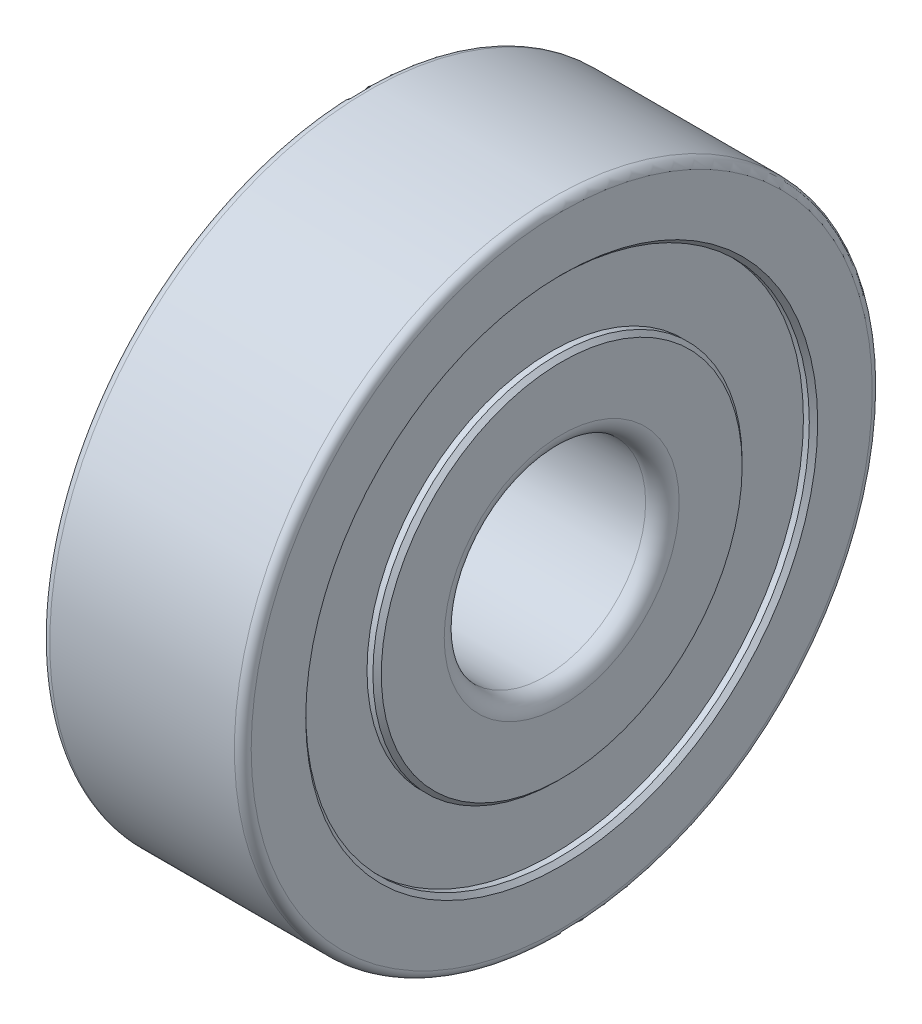
ISO-10303-21;
HEADER;
FILE_DESCRIPTION(('STEP AP214'),'2;1');
FILE_NAME('part.step','',(''),(''),'','','');
FILE_SCHEMA(('AUTOMOTIVE_DESIGN { 1 0 10303 214 1 1 1 1 }'));
ENDSEC;
DATA;
#1=APPLICATION_CONTEXT('core data for automotive mechanical design processes');
#2=APPLICATION_PROTOCOL_DEFINITION('international standard','automotive_design',2000,#1);
#3=PRODUCT_CONTEXT('',#1,'mechanical');
#4=PRODUCT('Part','Part','',(#3));
#5=PRODUCT_RELATED_PRODUCT_CATEGORY('part','',(#4));
#6=PRODUCT_DEFINITION_FORMATION('','',#4);
#7=PRODUCT_DEFINITION_CONTEXT('part definition',#1,'design');
#8=PRODUCT_DEFINITION('design','',#6,#7);
#9=PRODUCT_DEFINITION_SHAPE('','',#8);
#10=(LENGTH_UNIT() NAMED_UNIT(*) SI_UNIT(.MILLI.,.METRE.));
#11=(NAMED_UNIT(*) PLANE_ANGLE_UNIT() SI_UNIT($,.RADIAN.));
#12=(NAMED_UNIT(*) SI_UNIT($,.STERADIAN.) SOLID_ANGLE_UNIT());
#13=UNCERTAINTY_MEASURE_WITH_UNIT(LENGTH_MEASURE(1.E-05),#10,'distance_accuracy_value','');
#14=(GEOMETRIC_REPRESENTATION_CONTEXT(3) GLOBAL_UNCERTAINTY_ASSIGNED_CONTEXT((#13)) GLOBAL_UNIT_ASSIGNED_CONTEXT((#10,
#11,#12)) REPRESENTATION_CONTEXT('',''));
#15=CARTESIAN_POINT('',(0.,0.,0.));
#16=DIRECTION('',(0.,0.,1.));
#17=DIRECTION('',(1.,0.,0.));
#18=AXIS2_PLACEMENT_3D('',#15,#16,#17);
#19=CARTESIAN_POINT('',(-3.,4.41941738241598,-4.41941738241587));
#20=DIRECTION('',(0.,0.707106781186556,-0.707106781186539));
#21=DIRECTION('',(1.,0.,0.));
#22=AXIS2_PLACEMENT_3D('',#19,#20,#21);
#23=SPHERICAL_SURFACE('',#22,1.5);
#24=CARTESIAN_POINT('',(-3.,5.48007755419581,-5.48007755419568));
#25=VERTEX_POINT('',#24);
#26=VERTEX_LOOP('',#25);
#27=FACE_BOUND('',#26,.T.);
#28=ADVANCED_FACE('F41',(#27),#23,.T.);
#29=CLOSED_SHELL('',(#28));
#30=MANIFOLD_SOLID_BREP('B2',#29);
#31=CARTESIAN_POINT('',(-3.,0.,-6.25));
#32=DIRECTION('',(0.,0.,-1.));
#33=DIRECTION('',(1.,0.,0.));
#34=AXIS2_PLACEMENT_3D('',#31,#32,#33);
#35=SPHERICAL_SURFACE('',#34,1.5);
#36=CARTESIAN_POINT('',(-3.,0.,-7.75));
#37=VERTEX_POINT('',#36);
#38=VERTEX_LOOP('',#37);
#39=FACE_BOUND('',#38,.T.);
#40=ADVANCED_FACE('F59',(#39),#35,.T.);
#41=CLOSED_SHELL('',(#40));
#42=MANIFOLD_SOLID_BREP('B6',#41);
#43=CARTESIAN_POINT('',(-3.,-4.41941738241588,-4.41941738241596));
#44=DIRECTION('',(0.,-0.707106781186541,-0.707106781186554));
#45=DIRECTION('',(1.,0.,0.));
#46=AXIS2_PLACEMENT_3D('',#43,#44,#45);
#47=SPHERICAL_SURFACE('',#46,1.5);
#48=CARTESIAN_POINT('',(-3.,-5.4800775541957,-5.48007755419579));
#49=VERTEX_POINT('',#48);
#50=VERTEX_LOOP('',#49);
#51=FACE_BOUND('',#50,.T.);
#52=ADVANCED_FACE('F77',(#51),#47,.T.);
#53=CLOSED_SHELL('',(#52));
#54=MANIFOLD_SOLID_BREP('B37',#53);
#55=CARTESIAN_POINT('',(-3.,-6.25,0.));
#56=DIRECTION('',(0.,-1.,0.));
#57=DIRECTION('',(1.,0.,0.));
#58=AXIS2_PLACEMENT_3D('',#55,#56,#57);
#59=SPHERICAL_SURFACE('',#58,1.5);
#60=CARTESIAN_POINT('',(-3.,-7.75,0.));
#61=VERTEX_POINT('',#60);
#62=VERTEX_LOOP('',#61);
#63=FACE_BOUND('',#62,.T.);
#64=ADVANCED_FACE('F95',(#63),#59,.T.);
#65=CLOSED_SHELL('',(#64));
#66=MANIFOLD_SOLID_BREP('B55',#65);
#67=CARTESIAN_POINT('',(-3.,-4.41941738241595,4.4194173824159));
#68=DIRECTION('',(0.,-0.707106781186551,0.707106781186544));
#69=DIRECTION('',(1.,0.,0.));
#70=AXIS2_PLACEMENT_3D('',#67,#68,#69);
#71=SPHERICAL_SURFACE('',#70,1.5);
#72=CARTESIAN_POINT('',(-3.,-5.48007755419577,5.48007755419571));
#73=VERTEX_POINT('',#72);
#74=VERTEX_LOOP('',#73);
#75=FACE_BOUND('',#74,.T.);
#76=ADVANCED_FACE('F113',(#75),#71,.T.);
#77=CLOSED_SHELL('',(#76));
#78=MANIFOLD_SOLID_BREP('B73',#77);
#79=CARTESIAN_POINT('',(-3.,0.,6.25));
#80=DIRECTION('',(0.,0.,1.));
#81=DIRECTION('',(1.,0.,0.));
#82=AXIS2_PLACEMENT_3D('',#79,#80,#81);
#83=SPHERICAL_SURFACE('',#82,1.5);
#84=CARTESIAN_POINT('',(-3.,0.,7.75));
#85=VERTEX_POINT('',#84);
#86=VERTEX_LOOP('',#85);
#87=FACE_BOUND('',#86,.T.);
#88=ADVANCED_FACE('F131',(#87),#83,.T.);
#89=CLOSED_SHELL('',(#88));
#90=MANIFOLD_SOLID_BREP('B91',#89);
#91=CARTESIAN_POINT('',(-3.,4.41941738241592,4.41941738241593));
#92=DIRECTION('',(0.,0.707106781186546,0.707106781186549));
#93=DIRECTION('',(1.,0.,0.));
#94=AXIS2_PLACEMENT_3D('',#91,#92,#93);
#95=SPHERICAL_SURFACE('',#94,1.5);
#96=CARTESIAN_POINT('',(-3.,5.48007755419573,5.48007755419575));
#97=VERTEX_POINT('',#96);
#98=VERTEX_LOOP('',#97);
#99=FACE_BOUND('',#98,.T.);
#100=ADVANCED_FACE('F149',(#99),#95,.T.);
#101=CLOSED_SHELL('',(#100));
#102=MANIFOLD_SOLID_BREP('B109',#101);
#103=CARTESIAN_POINT('',(-3.,6.25,0.));
#104=DIRECTION('',(0.,1.,0.));
#105=DIRECTION('',(1.,0.,0.));
#106=AXIS2_PLACEMENT_3D('',#103,#104,#105);
#107=SPHERICAL_SURFACE('',#106,1.5);
#108=CARTESIAN_POINT('',(-3.,7.75,0.));
#109=VERTEX_POINT('',#108);
#110=VERTEX_LOOP('',#109);
#111=FACE_BOUND('',#110,.T.);
#112=ADVANCED_FACE('F168',(#111),#107,.T.);
#113=CLOSED_SHELL('',(#112));
#114=MANIFOLD_SOLID_BREP('B127',#113);
#115=CARTESIAN_POINT('',(0.,0.,0.));
#116=DIRECTION('',(1.,0.,0.));
#117=DIRECTION('',(0.,0.,-1.));
#118=AXIS2_PLACEMENT_3D('',#115,#116,#117);
#119=PLANE('',#118);
#120=CARTESIAN_POINT('',(0.,0.,0.));
#121=DIRECTION('',(1.,0.,0.));
#122=DIRECTION('',(0.,0.,-1.));
#123=AXIS2_PLACEMENT_3D('',#120,#121,#122);
#124=CIRCLE('',#123,9.25);
#125=CARTESIAN_POINT('',(0.,0.,-9.25));
#126=VERTEX_POINT('',#125);
#127=EDGE_CURVE('E196',#126,#126,#124,.T.);
#128=ORIENTED_EDGE('',*,*,#127,.T.);
#129=EDGE_LOOP('',(#128));
#130=FACE_BOUND('',#129,.T.);
#131=CARTESIAN_POINT('',(0.,0.,0.));
#132=DIRECTION('',(1.,0.,0.));
#133=DIRECTION('',(0.,0.,-1.));
#134=AXIS2_PLACEMENT_3D('',#131,#132,#133);
#135=CIRCLE('',#134,7.625);
#136=CARTESIAN_POINT('',(0.,0.,-7.625));
#137=VERTEX_POINT('',#136);
#138=EDGE_CURVE('E225',#137,#137,#135,.T.);
#139=ORIENTED_EDGE('',*,*,#138,.F.);
#140=EDGE_LOOP('',(#139));
#141=FACE_BOUND('',#140,.T.);
#142=ADVANCED_FACE('F181',(#130,#141),#119,.T.);
#143=CARTESIAN_POINT('',(-0.25,0.,0.));
#144=DIRECTION('',(1.,0.,0.));
#145=DIRECTION('',(0.,0.,-1.));
#146=AXIS2_PLACEMENT_3D('',#143,#144,#145);
#147=TOROIDAL_SURFACE('',#146,9.25,0.25);
#148=CARTESIAN_POINT('',(-0.250000000000002,0.,0.));
#149=DIRECTION('',(1.,0.,0.));
#150=DIRECTION('',(0.,0.,-1.));
#151=AXIS2_PLACEMENT_3D('',#148,#149,#150);
#152=CIRCLE('',#151,9.5);
#153=CARTESIAN_POINT('',(-0.250000000000002,0.,-9.5));
#154=VERTEX_POINT('',#153);
#155=EDGE_CURVE('E201',#154,#154,#152,.T.);
#156=ORIENTED_EDGE('',*,*,#155,.T.);
#157=EDGE_LOOP('',(#156));
#158=FACE_BOUND('',#157,.T.);
#159=ORIENTED_EDGE('',*,*,#127,.F.);
#160=EDGE_LOOP('',(#159));
#161=FACE_BOUND('',#160,.T.);
#162=ADVANCED_FACE('F290',(#158,#161),#147,.T.);
#163=CARTESIAN_POINT('',(0.,0.,0.));
#164=DIRECTION('',(1.,0.,0.));
#165=DIRECTION('',(0.,0.,-1.));
#166=AXIS2_PLACEMENT_3D('',#163,#164,#165);
#167=CYLINDRICAL_SURFACE('',#166,9.5);
#168=CARTESIAN_POINT('',(-5.75,0.,0.));
#169=DIRECTION('',(1.,0.,0.));
#170=DIRECTION('',(0.,0.,-1.));
#171=AXIS2_PLACEMENT_3D('',#168,#169,#170);
#172=CIRCLE('',#171,9.5);
#173=CARTESIAN_POINT('',(-5.75,0.,-9.5));
#174=VERTEX_POINT('',#173);
#175=EDGE_CURVE('E204',#174,#174,#172,.T.);
#176=ORIENTED_EDGE('',*,*,#175,.T.);
#177=EDGE_LOOP('',(#176));
#178=FACE_BOUND('',#177,.T.);
#179=ORIENTED_EDGE('',*,*,#155,.F.);
#180=EDGE_LOOP('',(#179));
#181=FACE_BOUND('',#180,.T.);
#182=ADVANCED_FACE('F295',(#178,#181),#167,.T.);
#183=CARTESIAN_POINT('',(-5.75,0.,0.));
#184=DIRECTION('',(1.,0.,0.));
#185=DIRECTION('',(0.,0.,-1.));
#186=AXIS2_PLACEMENT_3D('',#183,#184,#185);
#187=TOROIDAL_SURFACE('',#186,9.25,0.25);
#188=CARTESIAN_POINT('',(-6.,0.,0.));
#189=DIRECTION('',(1.,0.,0.));
#190=DIRECTION('',(0.,0.,-1.));
#191=AXIS2_PLACEMENT_3D('',#188,#189,#190);
#192=CIRCLE('',#191,9.25);
#193=CARTESIAN_POINT('',(-6.,0.,-9.25));
#194=VERTEX_POINT('',#193);
#195=EDGE_CURVE('E207',#194,#194,#192,.T.);
#196=ORIENTED_EDGE('',*,*,#195,.T.);
#197=EDGE_LOOP('',(#196));
#198=FACE_BOUND('',#197,.T.);
#199=ORIENTED_EDGE('',*,*,#175,.F.);
#200=EDGE_LOOP('',(#199));
#201=FACE_BOUND('',#200,.T.);
#202=ADVANCED_FACE('F527',(#198,#201),#187,.T.);
#203=CARTESIAN_POINT('',(-6.,0.,0.));
#204=DIRECTION('',(1.,0.,0.));
#205=DIRECTION('',(0.,0.,-1.));
#206=AXIS2_PLACEMENT_3D('',#203,#204,#205);
#207=PLANE('',#206);
#208=ORIENTED_EDGE('',*,*,#195,.F.);
#209=EDGE_LOOP('',(#208));
#210=FACE_BOUND('',#209,.T.);
#211=CARTESIAN_POINT('',(-6.,0.,0.));
#212=DIRECTION('',(1.,0.,0.));
#213=DIRECTION('',(0.,0.,-1.));
#214=AXIS2_PLACEMENT_3D('',#211,#212,#213);
#215=CIRCLE('',#214,7.625);
#216=CARTESIAN_POINT('',(-6.,0.,-7.625));
#217=VERTEX_POINT('',#216);
#218=EDGE_CURVE('E210',#217,#217,#215,.T.);
#219=ORIENTED_EDGE('',*,*,#218,.T.);
#220=EDGE_LOOP('',(#219));
#221=FACE_BOUND('',#220,.T.);
#222=ADVANCED_FACE('F517',(#210,#221),#207,.F.);
#223=CARTESIAN_POINT('',(-5.875,0.,0.));
#224=DIRECTION('',(-1.,0.,0.));
#225=DIRECTION('',(0.,0.,1.));
#226=AXIS2_PLACEMENT_3D('',#223,#224,#225);
#227=CONICAL_SURFACE('',#226,7.5,0.785398163397448);
#228=ORIENTED_EDGE('',*,*,#218,.F.);
#229=EDGE_LOOP('',(#228));
#230=FACE_BOUND('',#229,.T.);
#231=CARTESIAN_POINT('',(-5.875,0.,0.));
#232=DIRECTION('',(1.,0.,0.));
#233=DIRECTION('',(0.,0.,-1.));
#234=AXIS2_PLACEMENT_3D('',#231,#232,#233);
#235=CIRCLE('',#234,7.5);
#236=CARTESIAN_POINT('',(-5.875,0.,-7.5));
#237=VERTEX_POINT('',#236);
#238=EDGE_CURVE('E213',#237,#237,#235,.T.);
#239=ORIENTED_EDGE('',*,*,#238,.T.);
#240=EDGE_LOOP('',(#239));
#241=FACE_BOUND('',#240,.T.);
#242=ADVANCED_FACE('F317',(#230,#241),#227,.F.);
#243=CARTESIAN_POINT('',(0.,0.,0.));
#244=DIRECTION('',(1.,0.,0.));
#245=DIRECTION('',(0.,0.,-1.));
#246=AXIS2_PLACEMENT_3D('',#243,#244,#245);
#247=CYLINDRICAL_SURFACE('',#246,7.5);
#248=CARTESIAN_POINT('',(-5.7,0.,0.));
#249=DIRECTION('',(-1.,0.,0.));
#250=DIRECTION('',(0.,0.,1.));
#251=AXIS2_PLACEMENT_3D('',#248,#249,#250);
#252=CIRCLE('',#251,7.5);
#253=CARTESIAN_POINT('',(-5.7,0.,7.5));
#254=VERTEX_POINT('',#253);
#255=EDGE_CURVE('E167',#254,#254,#252,.T.);
#256=ORIENTED_EDGE('',*,*,#255,.F.);
#257=EDGE_LOOP('',(#256));
#258=FACE_BOUND('',#257,.T.);
#259=ORIENTED_EDGE('',*,*,#238,.F.);
#260=EDGE_LOOP('',(#259));
#261=FACE_BOUND('',#260,.T.);
#262=ADVANCED_FACE('F310',(#258,#261),#247,.F.);
#263=CARTESIAN_POINT('',(0.,0.,0.));
#264=DIRECTION('',(1.,0.,0.));
#265=DIRECTION('',(0.,0.,-1.));
#266=AXIS2_PLACEMENT_3D('',#263,#264,#265);
#267=CYLINDRICAL_SURFACE('',#266,7.5);
#268=CARTESIAN_POINT('',(-0.3,0.,0.));
#269=DIRECTION('',(1.,0.,0.));
#270=DIRECTION('',(0.,0.,-1.));
#271=AXIS2_PLACEMENT_3D('',#268,#269,#270);
#272=CIRCLE('',#271,7.5);
#273=CARTESIAN_POINT('',(-0.3,0.,-7.5));
#274=VERTEX_POINT('',#273);
#275=EDGE_CURVE('E192',#274,#274,#272,.T.);
#276=ORIENTED_EDGE('',*,*,#275,.F.);
#277=EDGE_LOOP('',(#276));
#278=FACE_BOUND('',#277,.T.);
#279=CARTESIAN_POINT('',(-0.125,0.,0.));
#280=DIRECTION('',(1.,0.,0.));
#281=DIRECTION('',(0.,0.,-1.));
#282=AXIS2_PLACEMENT_3D('',#279,#280,#281);
#283=CIRCLE('',#282,7.5);
#284=CARTESIAN_POINT('',(-0.125,0.,-7.5));
#285=VERTEX_POINT('',#284);
#286=EDGE_CURVE('E222',#285,#285,#283,.T.);
#287=ORIENTED_EDGE('',*,*,#286,.T.);
#288=EDGE_LOOP('',(#287));
#289=FACE_BOUND('',#288,.T.);
#290=ADVANCED_FACE('F305',(#278,#289),#267,.F.);
#291=CARTESIAN_POINT('',(-0.125,0.,0.));
#292=DIRECTION('',(1.,0.,0.));
#293=DIRECTION('',(0.,0.,-1.));
#294=AXIS2_PLACEMENT_3D('',#291,#292,#293);
#295=CONICAL_SURFACE('',#294,7.5,0.785398163397449);
#296=ORIENTED_EDGE('',*,*,#138,.T.);
#297=EDGE_LOOP('',(#296));
#298=FACE_BOUND('',#297,.T.);
#299=ORIENTED_EDGE('',*,*,#286,.F.);
#300=EDGE_LOOP('',(#299));
#301=FACE_BOUND('',#300,.T.);
#302=ADVANCED_FACE('F301',(#298,#301),#295,.F.);
#303=CARTESIAN_POINT('',(-0.3,0.,0.));
#304=DIRECTION('',(1.,0.,0.));
#305=DIRECTION('',(0.,0.,-1.));
#306=AXIS2_PLACEMENT_3D('',#303,#304,#305);
#307=PLANE('',#306);
#308=ORIENTED_EDGE('',*,*,#275,.T.);
#309=EDGE_LOOP('',(#308));
#310=FACE_BOUND('',#309,.T.);
#311=CARTESIAN_POINT('',(-0.3,0.,0.));
#312=DIRECTION('',(1.,0.,0.));
#313=DIRECTION('',(0.,0.,-1.));
#314=AXIS2_PLACEMENT_3D('',#311,#312,#313);
#315=CIRCLE('',#314,5.5);
#316=CARTESIAN_POINT('',(-0.3,0.,-5.5));
#317=VERTEX_POINT('',#316);
#318=EDGE_CURVE('E231',#317,#317,#315,.T.);
#319=ORIENTED_EDGE('',*,*,#318,.F.);
#320=EDGE_LOOP('',(#319));
#321=FACE_BOUND('',#320,.T.);
#322=ADVANCED_FACE('F304',(#310,#321),#307,.T.);
#323=CARTESIAN_POINT('',(-0.5,0.,0.));
#324=DIRECTION('',(1.,0.,0.));
#325=DIRECTION('',(0.,0.,-1.));
#326=AXIS2_PLACEMENT_3D('',#323,#324,#325);
#327=TOROIDAL_SURFACE('',#326,3.5,0.5);
#328=CARTESIAN_POINT('',(-0.500000000000003,0.,0.));
#329=DIRECTION('',(1.,0.,0.));
#330=DIRECTION('',(0.,0.,-1.));
#331=AXIS2_PLACEMENT_3D('',#328,#329,#330);
#332=CIRCLE('',#331,3.);
#333=CARTESIAN_POINT('',(-0.500000000000003,0.,-3.));
#334=VERTEX_POINT('',#333);
#335=EDGE_CURVE('E264',#334,#334,#332,.T.);
#336=ORIENTED_EDGE('',*,*,#335,.F.);
#337=EDGE_LOOP('',(#336));
#338=FACE_BOUND('',#337,.T.);
#339=CARTESIAN_POINT('',(0.,0.,0.));
#340=DIRECTION('',(1.,0.,0.));
#341=DIRECTION('',(0.,0.,-1.));
#342=AXIS2_PLACEMENT_3D('',#339,#340,#341);
#343=CIRCLE('',#342,3.5);
#344=CARTESIAN_POINT('',(0.,0.,-3.5));
#345=VERTEX_POINT('',#344);
#346=EDGE_CURVE('E237',#345,#345,#343,.T.);
#347=ORIENTED_EDGE('',*,*,#346,.T.);
#348=EDGE_LOOP('',(#347));
#349=FACE_BOUND('',#348,.T.);
#350=ADVANCED_FACE('F373',(#338,#349),#327,.T.);
#351=CARTESIAN_POINT('',(0.,0.,0.));
#352=DIRECTION('',(1.,0.,0.));
#353=DIRECTION('',(0.,0.,-1.));
#354=AXIS2_PLACEMENT_3D('',#351,#352,#353);
#355=PLANE('',#354);
#356=CARTESIAN_POINT('',(0.,0.,0.));
#357=DIRECTION('',(1.,0.,0.));
#358=DIRECTION('',(0.,0.,-1.));
#359=AXIS2_PLACEMENT_3D('',#356,#357,#358);
#360=CIRCLE('',#359,5.375);
#361=CARTESIAN_POINT('',(0.,0.,-5.375));
#362=VERTEX_POINT('',#361);
#363=EDGE_CURVE('E240',#362,#362,#360,.T.);
#364=ORIENTED_EDGE('',*,*,#363,.T.);
#365=EDGE_LOOP('',(#364));
#366=FACE_BOUND('',#365,.T.);
#367=ORIENTED_EDGE('',*,*,#346,.F.);
#368=EDGE_LOOP('',(#367));
#369=FACE_BOUND('',#368,.T.);
#370=ADVANCED_FACE('F365',(#366,#369),#355,.T.);
#371=CARTESIAN_POINT('',(-0.125,0.,0.));
#372=DIRECTION('',(-1.,0.,0.));
#373=DIRECTION('',(0.,0.,1.));
#374=AXIS2_PLACEMENT_3D('',#371,#372,#373);
#375=CONICAL_SURFACE('',#374,5.5,0.785398163397449);
#376=ORIENTED_EDGE('',*,*,#363,.F.);
#377=EDGE_LOOP('',(#376));
#378=FACE_BOUND('',#377,.T.);
#379=CARTESIAN_POINT('',(-0.125,0.,0.));
#380=DIRECTION('',(1.,0.,0.));
#381=DIRECTION('',(0.,0.,-1.));
#382=AXIS2_PLACEMENT_3D('',#379,#380,#381);
#383=CIRCLE('',#382,5.5);
#384=CARTESIAN_POINT('',(-0.125,0.,-5.5));
#385=VERTEX_POINT('',#384);
#386=EDGE_CURVE('E243',#385,#385,#383,.T.);
#387=ORIENTED_EDGE('',*,*,#386,.T.);
#388=EDGE_LOOP('',(#387));
#389=FACE_BOUND('',#388,.T.);
#390=ADVANCED_FACE('F357',(#378,#389),#375,.T.);
#391=CARTESIAN_POINT('',(0.,0.,0.));
#392=DIRECTION('',(1.,0.,0.));
#393=DIRECTION('',(0.,0.,-1.));
#394=AXIS2_PLACEMENT_3D('',#391,#392,#393);
#395=CYLINDRICAL_SURFACE('',#394,5.5);
#396=ORIENTED_EDGE('',*,*,#318,.T.);
#397=EDGE_LOOP('',(#396));
#398=FACE_BOUND('',#397,.T.);
#399=ORIENTED_EDGE('',*,*,#386,.F.);
#400=EDGE_LOOP('',(#399));
#401=FACE_BOUND('',#400,.T.);
#402=ADVANCED_FACE('F348',(#398,#401),#395,.T.);
#403=CARTESIAN_POINT('',(0.,0.,0.));
#404=DIRECTION('',(1.,0.,0.));
#405=DIRECTION('',(0.,0.,-1.));
#406=AXIS2_PLACEMENT_3D('',#403,#404,#405);
#407=CYLINDRICAL_SURFACE('',#406,5.5);
#408=CARTESIAN_POINT('',(-5.7,0.,0.));
#409=DIRECTION('',(-1.,0.,0.));
#410=DIRECTION('',(0.,0.,1.));
#411=AXIS2_PLACEMENT_3D('',#408,#409,#410);
#412=CIRCLE('',#411,5.5);
#413=CARTESIAN_POINT('',(-5.7,0.,5.5));
#414=VERTEX_POINT('',#413);
#415=EDGE_CURVE('E270',#414,#414,#412,.T.);
#416=ORIENTED_EDGE('',*,*,#415,.T.);
#417=EDGE_LOOP('',(#416));
#418=FACE_BOUND('',#417,.T.);
#419=CARTESIAN_POINT('',(-5.875,0.,0.));
#420=DIRECTION('',(1.,0.,0.));
#421=DIRECTION('',(0.,0.,-1.));
#422=AXIS2_PLACEMENT_3D('',#419,#420,#421);
#423=CIRCLE('',#422,5.5);
#424=CARTESIAN_POINT('',(-5.875,0.,-5.5));
#425=VERTEX_POINT('',#424);
#426=EDGE_CURVE('E252',#425,#425,#423,.T.);
#427=ORIENTED_EDGE('',*,*,#426,.T.);
#428=EDGE_LOOP('',(#427));
#429=FACE_BOUND('',#428,.T.);
#430=ADVANCED_FACE('F274',(#418,#429),#407,.T.);
#431=CARTESIAN_POINT('',(-6.,0.,0.));
#432=DIRECTION('',(1.,0.,0.));
#433=DIRECTION('',(0.,0.,-1.));
#434=AXIS2_PLACEMENT_3D('',#431,#432,#433);
#435=CONICAL_SURFACE('',#434,5.375,0.785398163397448);
#436=ORIENTED_EDGE('',*,*,#426,.F.);
#437=EDGE_LOOP('',(#436));
#438=FACE_BOUND('',#437,.T.);
#439=CARTESIAN_POINT('',(-6.,0.,0.));
#440=DIRECTION('',(1.,0.,0.));
#441=DIRECTION('',(0.,0.,-1.));
#442=AXIS2_PLACEMENT_3D('',#439,#440,#441);
#443=CIRCLE('',#442,5.375);
#444=CARTESIAN_POINT('',(-6.,0.,-5.375));
#445=VERTEX_POINT('',#444);
#446=EDGE_CURVE('E255',#445,#445,#443,.T.);
#447=ORIENTED_EDGE('',*,*,#446,.T.);
#448=EDGE_LOOP('',(#447));
#449=FACE_BOUND('',#448,.T.);
#450=ADVANCED_FACE('F363',(#438,#449),#435,.T.);
#451=CARTESIAN_POINT('',(-6.,0.,0.));
#452=DIRECTION('',(1.,0.,0.));
#453=DIRECTION('',(0.,0.,-1.));
#454=AXIS2_PLACEMENT_3D('',#451,#452,#453);
#455=PLANE('',#454);
#456=ORIENTED_EDGE('',*,*,#446,.F.);
#457=EDGE_LOOP('',(#456));
#458=FACE_BOUND('',#457,.T.);
#459=CARTESIAN_POINT('',(-6.,0.,0.));
#460=DIRECTION('',(1.,0.,0.));
#461=DIRECTION('',(0.,0.,-1.));
#462=AXIS2_PLACEMENT_3D('',#459,#460,#461);
#463=CIRCLE('',#462,3.5);
#464=CARTESIAN_POINT('',(-6.,0.,-3.5));
#465=VERTEX_POINT('',#464);
#466=EDGE_CURVE('E258',#465,#465,#463,.T.);
#467=ORIENTED_EDGE('',*,*,#466,.T.);
#468=EDGE_LOOP('',(#467));
#469=FACE_BOUND('',#468,.T.);
#470=ADVANCED_FACE('F417',(#458,#469),#455,.F.);
#471=CARTESIAN_POINT('',(-5.5,0.,0.));
#472=DIRECTION('',(1.,0.,0.));
#473=DIRECTION('',(0.,0.,-1.));
#474=AXIS2_PLACEMENT_3D('',#471,#472,#473);
#475=TOROIDAL_SURFACE('',#474,3.5,0.5);
#476=ORIENTED_EDGE('',*,*,#466,.F.);
#477=EDGE_LOOP('',(#476));
#478=FACE_BOUND('',#477,.T.);
#479=CARTESIAN_POINT('',(-5.5,0.,0.));
#480=DIRECTION('',(1.,0.,0.));
#481=DIRECTION('',(0.,0.,-1.));
#482=AXIS2_PLACEMENT_3D('',#479,#480,#481);
#483=CIRCLE('',#482,3.);
#484=CARTESIAN_POINT('',(-5.5,0.,-3.));
#485=VERTEX_POINT('',#484);
#486=EDGE_CURVE('E261',#485,#485,#483,.T.);
#487=ORIENTED_EDGE('',*,*,#486,.T.);
#488=EDGE_LOOP('',(#487));
#489=FACE_BOUND('',#488,.T.);
#490=ADVANCED_FACE('F285',(#478,#489),#475,.T.);
#491=CARTESIAN_POINT('',(0.,0.,0.));
#492=DIRECTION('',(1.,0.,0.));
#493=DIRECTION('',(0.,0.,-1.));
#494=AXIS2_PLACEMENT_3D('',#491,#492,#493);
#495=CYLINDRICAL_SURFACE('',#494,3.);
#496=ORIENTED_EDGE('',*,*,#486,.F.);
#497=EDGE_LOOP('',(#496));
#498=FACE_BOUND('',#497,.T.);
#499=ORIENTED_EDGE('',*,*,#335,.T.);
#500=EDGE_LOOP('',(#499));
#501=FACE_BOUND('',#500,.T.);
#502=ADVANCED_FACE('F279',(#498,#501),#495,.F.);
#503=CARTESIAN_POINT('',(-5.7,0.,0.));
#504=DIRECTION('',(-1.,0.,0.));
#505=DIRECTION('',(0.,0.,1.));
#506=AXIS2_PLACEMENT_3D('',#503,#504,#505);
#507=PLANE('',#506);
#508=ORIENTED_EDGE('',*,*,#255,.T.);
#509=EDGE_LOOP('',(#508));
#510=FACE_BOUND('',#509,.T.);
#511=ORIENTED_EDGE('',*,*,#415,.F.);
#512=EDGE_LOOP('',(#511));
#513=FACE_BOUND('',#512,.T.);
#514=ADVANCED_FACE('F277',(#510,#513),#507,.T.);
#515=CLOSED_SHELL('',(#142,#162,#182,#202,#222,#242,#262,#290,#302,#322,#350,#370,#390,#402,
#430,#450,#470,#490,#502,#514));
#516=CARTESIAN_POINT('',(-5.5,0.,0.));
#517=DIRECTION('',(-1.,0.,0.));
#518=DIRECTION('',(0.,0.,1.));
#519=AXIS2_PLACEMENT_3D('',#516,#517,#518);
#520=PLANE('',#519);
#521=CARTESIAN_POINT('',(-5.5,0.,0.));
#522=DIRECTION('',(-1.,0.,0.));
#523=DIRECTION('',(0.,0.,1.));
#524=AXIS2_PLACEMENT_3D('',#521,#522,#523);
#525=CIRCLE('',#524,7.5);
#526=CARTESIAN_POINT('',(-5.5,0.,7.5));
#527=VERTEX_POINT('',#526);
#528=EDGE_CURVE('E267',#527,#527,#525,.T.);
#529=ORIENTED_EDGE('',*,*,#528,.F.);
#530=EDGE_LOOP('',(#529));
#531=FACE_BOUND('',#530,.T.);
#532=CARTESIAN_POINT('',(-5.5,0.,0.));
#533=DIRECTION('',(-1.,0.,0.));
#534=DIRECTION('',(0.,0.,1.));
#535=AXIS2_PLACEMENT_3D('',#532,#533,#534);
#536=CIRCLE('',#535,5.5);
#537=CARTESIAN_POINT('',(-5.5,0.,5.5));
#538=VERTEX_POINT('',#537);
#539=EDGE_CURVE('E188',#538,#538,#536,.T.);
#540=ORIENTED_EDGE('',*,*,#539,.T.);
#541=EDGE_LOOP('',(#540));
#542=FACE_BOUND('',#541,.T.);
#543=ADVANCED_FACE('F325',(#531,#542),#520,.F.);
#544=CARTESIAN_POINT('',(-2.17084380241115,0.,0.));
#545=DIRECTION('',(1.,0.,0.));
#546=DIRECTION('',(0.,0.,-1.));
#547=AXIS2_PLACEMENT_3D('',#544,#545,#546);
#548=CIRCLE('',#547,7.5);
#549=CARTESIAN_POINT('',(-2.17084380241115,0.,-7.5));
#550=VERTEX_POINT('',#549);
#551=EDGE_CURVE('E219',#550,#550,#548,.T.);
#552=ORIENTED_EDGE('',*,*,#551,.F.);
#553=EDGE_LOOP('',(#552));
#554=FACE_BOUND('',#553,.T.);
#555=CARTESIAN_POINT('',(-0.5,0.,0.));
#556=DIRECTION('',(1.,0.,0.));
#557=DIRECTION('',(0.,0.,-1.));
#558=AXIS2_PLACEMENT_3D('',#555,#556,#557);
#559=CIRCLE('',#558,7.5);
#560=CARTESIAN_POINT('',(-0.5,0.,-7.5));
#561=VERTEX_POINT('',#560);
#562=EDGE_CURVE('E228',#561,#561,#559,.T.);
#563=ORIENTED_EDGE('',*,*,#562,.T.);
#564=EDGE_LOOP('',(#563));
#565=FACE_BOUND('',#564,.T.);
#566=ADVANCED_FACE('F313',(#554,#565),#267,.F.);
#567=CARTESIAN_POINT('',(-3.,0.,0.));
#568=DIRECTION('',(1.,0.,0.));
#569=DIRECTION('',(0.,0.,-1.));
#570=AXIS2_PLACEMENT_3D('',#567,#568,#569);
#571=TOROIDAL_SURFACE('',#570,6.25,1.5);
#572=CARTESIAN_POINT('',(-3.82915619758885,0.,0.));
#573=DIRECTION('',(1.,0.,0.));
#574=DIRECTION('',(0.,0.,-1.));
#575=AXIS2_PLACEMENT_3D('',#572,#573,#574);
#576=CIRCLE('',#575,7.5);
#577=CARTESIAN_POINT('',(-3.82915619758885,0.,-7.5));
#578=VERTEX_POINT('',#577);
#579=EDGE_CURVE('E216',#578,#578,#576,.T.);
#580=ORIENTED_EDGE('',*,*,#579,.F.);
#581=EDGE_LOOP('',(#580));
#582=FACE_BOUND('',#581,.T.);
#583=ORIENTED_EDGE('',*,*,#551,.T.);
#584=EDGE_LOOP('',(#583));
#585=FACE_BOUND('',#584,.T.);
#586=ADVANCED_FACE('F324',(#582,#585),#571,.F.);
#587=ORIENTED_EDGE('',*,*,#579,.T.);
#588=EDGE_LOOP('',(#587));
#589=FACE_BOUND('',#588,.T.);
#590=ORIENTED_EDGE('',*,*,#528,.T.);
#591=EDGE_LOOP('',(#590));
#592=FACE_BOUND('',#591,.T.);
#593=ADVANCED_FACE('F320',(#589,#592),#247,.F.);
#594=CARTESIAN_POINT('',(-0.5,0.,0.));
#595=DIRECTION('',(1.,0.,0.));
#596=DIRECTION('',(0.,0.,-1.));
#597=AXIS2_PLACEMENT_3D('',#594,#595,#596);
#598=PLANE('',#597);
#599=ORIENTED_EDGE('',*,*,#562,.F.);
#600=EDGE_LOOP('',(#599));
#601=FACE_BOUND('',#600,.T.);
#602=CARTESIAN_POINT('',(-0.5,0.,0.));
#603=DIRECTION('',(1.,0.,0.));
#604=DIRECTION('',(0.,0.,-1.));
#605=AXIS2_PLACEMENT_3D('',#602,#603,#604);
#606=CIRCLE('',#605,5.5);
#607=CARTESIAN_POINT('',(-0.5,0.,-5.5));
#608=VERTEX_POINT('',#607);
#609=EDGE_CURVE('E234',#608,#608,#606,.F.);
#610=ORIENTED_EDGE('',*,*,#609,.F.);
#611=EDGE_LOOP('',(#610));
#612=FACE_BOUND('',#611,.T.);
#613=ADVANCED_FACE('F337',(#601,#612),#598,.F.);
#614=CARTESIAN_POINT('',(-1.70096189432334,0.,0.));
#615=DIRECTION('',(1.,0.,0.));
#616=DIRECTION('',(0.,0.,-1.));
#617=AXIS2_PLACEMENT_3D('',#614,#615,#616);
#618=CIRCLE('',#617,5.5);
#619=CARTESIAN_POINT('',(-1.70096189432334,0.,-5.5));
#620=VERTEX_POINT('',#619);
#621=EDGE_CURVE('E246',#620,#620,#618,.T.);
#622=ORIENTED_EDGE('',*,*,#621,.T.);
#623=EDGE_LOOP('',(#622));
#624=FACE_BOUND('',#623,.T.);
#625=ORIENTED_EDGE('',*,*,#609,.T.);
#626=EDGE_LOOP('',(#625));
#627=FACE_BOUND('',#626,.T.);
#628=ADVANCED_FACE('F340',(#624,#627),#395,.T.);
#629=CARTESIAN_POINT('',(-3.,0.,0.));
#630=DIRECTION('',(1.,0.,0.));
#631=DIRECTION('',(0.,0.,-1.));
#632=AXIS2_PLACEMENT_3D('',#629,#630,#631);
#633=TOROIDAL_SURFACE('',#632,6.25,1.5);
#634=CARTESIAN_POINT('',(-4.29903810567666,0.,0.));
#635=DIRECTION('',(1.,0.,0.));
#636=DIRECTION('',(0.,0.,-1.));
#637=AXIS2_PLACEMENT_3D('',#634,#635,#636);
#638=CIRCLE('',#637,5.5);
#639=CARTESIAN_POINT('',(-4.29903810567666,0.,-5.5));
#640=VERTEX_POINT('',#639);
#641=EDGE_CURVE('E249',#640,#640,#638,.T.);
#642=ORIENTED_EDGE('',*,*,#641,.T.);
#643=EDGE_LOOP('',(#642));
#644=FACE_BOUND('',#643,.T.);
#645=ORIENTED_EDGE('',*,*,#621,.F.);
#646=EDGE_LOOP('',(#645));
#647=FACE_BOUND('',#646,.T.);
#648=ADVANCED_FACE('F345',(#644,#647),#633,.F.);
#649=ORIENTED_EDGE('',*,*,#641,.F.);
#650=EDGE_LOOP('',(#649));
#651=FACE_BOUND('',#650,.T.);
#652=ORIENTED_EDGE('',*,*,#539,.F.);
#653=EDGE_LOOP('',(#652));
#654=FACE_BOUND('',#653,.T.);
#655=ADVANCED_FACE('F352',(#651,#654),#407,.T.);
#656=CLOSED_SHELL('',(#543,#566,#586,#593,#613,#628,#648,#655));
#657=ORIENTED_CLOSED_SHELL('',*,#656,.T.);
#658=BREP_WITH_VOIDS('B145',#515,(#657));
#659=ADVANCED_BREP_SHAPE_REPRESENTATION('',(#18,#30,#42,#54,#66,#78,#90,#102,#114,#658),#14);
#660=SHAPE_DEFINITION_REPRESENTATION(#9,#659);
ENDSEC;
END-ISO-10303-21;
